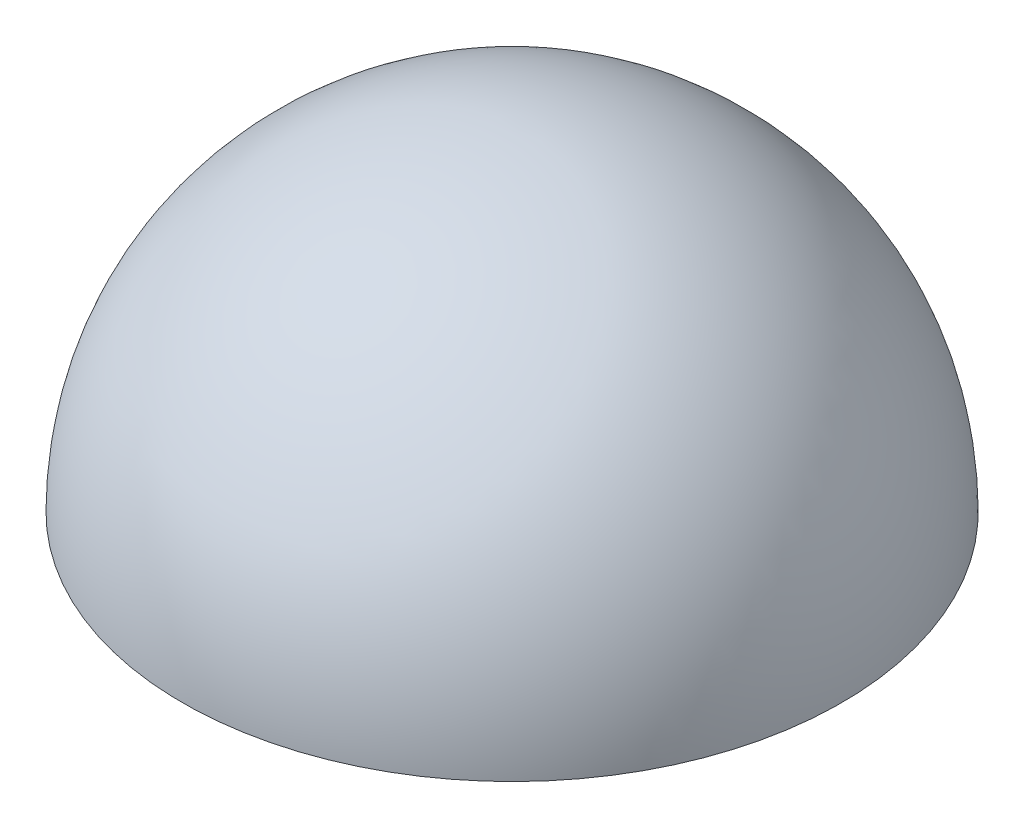
ISO-10303-21;
HEADER;
FILE_DESCRIPTION(('STEP AP214'),'2;1');
FILE_NAME('part.step','',(''),(''),'','','');
FILE_SCHEMA(('AUTOMOTIVE_DESIGN { 1 0 10303 214 1 1 1 1 }'));
ENDSEC;
DATA;
#1=APPLICATION_CONTEXT('core data for automotive mechanical design processes');
#2=APPLICATION_PROTOCOL_DEFINITION('international standard','automotive_design',2000,#1);
#3=PRODUCT_CONTEXT('',#1,'mechanical');
#4=PRODUCT('Part','Part','',(#3));
#5=PRODUCT_RELATED_PRODUCT_CATEGORY('part','',(#4));
#6=PRODUCT_DEFINITION_FORMATION('','',#4);
#7=PRODUCT_DEFINITION_CONTEXT('part definition',#1,'design');
#8=PRODUCT_DEFINITION('design','',#6,#7);
#9=PRODUCT_DEFINITION_SHAPE('','',#8);
#10=(LENGTH_UNIT() NAMED_UNIT(*) SI_UNIT(.MILLI.,.METRE.));
#11=(NAMED_UNIT(*) PLANE_ANGLE_UNIT() SI_UNIT($,.RADIAN.));
#12=(NAMED_UNIT(*) SI_UNIT($,.STERADIAN.) SOLID_ANGLE_UNIT());
#13=UNCERTAINTY_MEASURE_WITH_UNIT(LENGTH_MEASURE(1.E-05),#10,'distance_accuracy_value','');
#14=(GEOMETRIC_REPRESENTATION_CONTEXT(3) GLOBAL_UNCERTAINTY_ASSIGNED_CONTEXT((#13)) GLOBAL_UNIT_ASSIGNED_CONTEXT((#10,
#11,#12)) REPRESENTATION_CONTEXT('',''));
#15=CARTESIAN_POINT('',(0.,0.,0.));
#16=DIRECTION('',(0.,0.,1.));
#17=DIRECTION('',(1.,0.,0.));
#18=AXIS2_PLACEMENT_3D('',#15,#16,#17);
#19=CARTESIAN_POINT('',(0.,0.1,0.));
#20=DIRECTION('',(0.,0.,1.));
#21=DIRECTION('',(1.,0.,0.));
#22=AXIS2_PLACEMENT_3D('',#19,#20,#21);
#23=SPHERICAL_SURFACE('',#22,2.25);
#24=CARTESIAN_POINT('',(0.,0.1,0.));
#25=DIRECTION('',(0.,-1.,0.));
#26=DIRECTION('',(0.,0.,-1.));
#27=AXIS2_PLACEMENT_3D('',#24,#25,#26);
#28=SPHERICAL_SURFACE('',#27,2.25);
#29=CARTESIAN_POINT('',(0.,0.1,0.));
#30=DIRECTION('',(0.,-1.,0.));
#31=DIRECTION('',(0.,0.,-1.));
#32=AXIS2_PLACEMENT_3D('',#29,#30,#31);
#33=CIRCLE('',#32,2.25);
#34=CARTESIAN_POINT('',(0.,0.1,-2.25));
#35=VERTEX_POINT('',#34);
#36=EDGE_CURVE('E10',#35,#35,#33,.T.);
#37=ORIENTED_EDGE('',*,*,#36,.F.);
#38=EDGE_LOOP('',(#37));
#39=FACE_BOUND('',#38,.T.);
#40=ADVANCED_FACE('F34',(#39),#28,.T.);
#41=CARTESIAN_POINT('',(0.,0.1,0.));
#42=DIRECTION('',(0.,-1.,0.));
#43=DIRECTION('',(0.,0.,-1.));
#44=AXIS2_PLACEMENT_3D('',#41,#42,#43);
#45=PLANE('',#44);
#46=CARTESIAN_POINT('',(0.,0.1,0.));
#47=DIRECTION('',(0.,-1.,0.));
#48=DIRECTION('',(0.,0.,-1.));
#49=AXIS2_PLACEMENT_3D('',#46,#47,#48);
#50=CIRCLE('',#49,2.15);
#51=CARTESIAN_POINT('',(0.,0.1,-2.15));
#52=VERTEX_POINT('',#51);
#53=EDGE_CURVE('E40',#52,#52,#50,.T.);
#54=ORIENTED_EDGE('',*,*,#53,.F.);
#55=EDGE_LOOP('',(#54));
#56=FACE_BOUND('',#55,.T.);
#57=ORIENTED_EDGE('',*,*,#36,.T.);
#58=EDGE_LOOP('',(#57));
#59=FACE_BOUND('',#58,.T.);
#60=ADVANCED_FACE('F48',(#56,#59),#45,.T.);
#61=CARTESIAN_POINT('',(0.,0.1,0.));
#62=DIRECTION('',(0.,0.,1.));
#63=DIRECTION('',(1.,0.,0.));
#64=AXIS2_PLACEMENT_3D('',#61,#62,#63);
#65=SPHERICAL_SURFACE('',#64,2.15);
#66=CARTESIAN_POINT('',(0.,0.1,0.));
#67=DIRECTION('',(0.,-1.,0.));
#68=DIRECTION('',(0.,0.,-1.));
#69=AXIS2_PLACEMENT_3D('',#66,#67,#68);
#70=SPHERICAL_SURFACE('',#69,2.15);
#71=ORIENTED_EDGE('',*,*,#53,.T.);
#72=EDGE_LOOP('',(#71));
#73=FACE_BOUND('',#72,.T.);
#74=ADVANCED_FACE('F46',(#73),#70,.F.);
#75=CLOSED_SHELL('',(#40,#60,#74));
#76=MANIFOLD_SOLID_BREP('B2',#75);
#77=ADVANCED_BREP_SHAPE_REPRESENTATION('',(#18,#76),#14);
#78=SHAPE_DEFINITION_REPRESENTATION(#9,#77);
ENDSEC;
END-ISO-10303-21;
